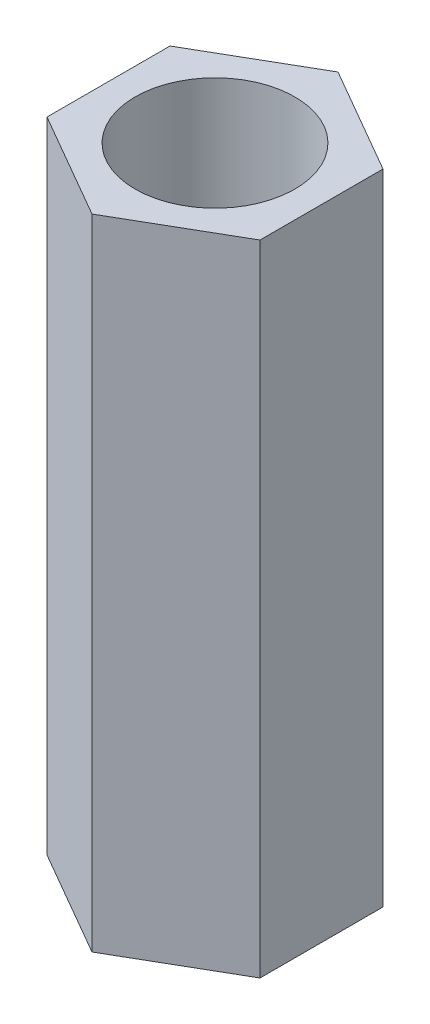
ISO-10303-21;
HEADER;
FILE_DESCRIPTION(('STEP AP214'),'2;1');
FILE_NAME('part.step','',(''),(''),'','','');
FILE_SCHEMA(('AUTOMOTIVE_DESIGN { 1 0 10303 214 1 1 1 1 }'));
ENDSEC;
DATA;
#1=APPLICATION_CONTEXT('core data for automotive mechanical design processes');
#2=APPLICATION_PROTOCOL_DEFINITION('international standard','automotive_design',2000,#1);
#3=PRODUCT_CONTEXT('',#1,'mechanical');
#4=PRODUCT('Part','Part','',(#3));
#5=PRODUCT_RELATED_PRODUCT_CATEGORY('part','',(#4));
#6=PRODUCT_DEFINITION_FORMATION('','',#4);
#7=PRODUCT_DEFINITION_CONTEXT('part definition',#1,'design');
#8=PRODUCT_DEFINITION('design','',#6,#7);
#9=PRODUCT_DEFINITION_SHAPE('','',#8);
#10=(LENGTH_UNIT() NAMED_UNIT(*) SI_UNIT(.MILLI.,.METRE.));
#11=(NAMED_UNIT(*) PLANE_ANGLE_UNIT() SI_UNIT($,.RADIAN.));
#12=(NAMED_UNIT(*) SI_UNIT($,.STERADIAN.) SOLID_ANGLE_UNIT());
#13=UNCERTAINTY_MEASURE_WITH_UNIT(LENGTH_MEASURE(1.E-05),#10,'distance_accuracy_value','');
#14=(GEOMETRIC_REPRESENTATION_CONTEXT(3) GLOBAL_UNCERTAINTY_ASSIGNED_CONTEXT((#13)) GLOBAL_UNIT_ASSIGNED_CONTEXT((#10,
#11,#12)) REPRESENTATION_CONTEXT('',''));
#15=CARTESIAN_POINT('',(0.,0.,0.));
#16=DIRECTION('',(0.,0.,1.));
#17=DIRECTION('',(1.,0.,0.));
#18=AXIS2_PLACEMENT_3D('',#15,#16,#17);
#19=CARTESIAN_POINT('',(0.,12.,0.));
#20=DIRECTION('',(0.,1.,0.));
#21=DIRECTION('',(0.,0.,1.));
#22=AXIS2_PLACEMENT_3D('',#19,#20,#21);
#23=PLANE('',#22);
#24=DIRECTION('',(-0.866025403784439,0.,-0.5));
#25=VECTOR('',#24,1.);
#26=CARTESIAN_POINT('',(2.,12.,-1.15470053837925));
#27=LINE('',#26,#25);
#28=CARTESIAN_POINT('',(2.,12.,-1.15470053837925));
#29=VERTEX_POINT('',#28);
#30=CARTESIAN_POINT('',(0.,12.,-2.3094010767585));
#31=VERTEX_POINT('',#30);
#32=EDGE_CURVE('E134',#29,#31,#27,.T.);
#33=ORIENTED_EDGE('',*,*,#32,.T.);
#34=DIRECTION('',(-0.866025403784439,0.,0.5));
#35=VECTOR('',#34,1.);
#36=CARTESIAN_POINT('',(0.,12.,-2.3094010767585));
#37=LINE('',#36,#35);
#38=CARTESIAN_POINT('',(-2.,12.,-1.15470053837925));
#39=VERTEX_POINT('',#38);
#40=EDGE_CURVE('E92',#31,#39,#37,.T.);
#41=ORIENTED_EDGE('',*,*,#40,.T.);
#42=DIRECTION('',(0.,0.,1.));
#43=VECTOR('',#42,1.);
#44=CARTESIAN_POINT('',(-2.,12.,-1.15470053837925));
#45=LINE('',#44,#43);
#46=CARTESIAN_POINT('',(-2.,12.,1.15470053837925));
#47=VERTEX_POINT('',#46);
#48=EDGE_CURVE('E105',#39,#47,#45,.T.);
#49=ORIENTED_EDGE('',*,*,#48,.T.);
#50=DIRECTION('',(0.866025403784439,0.,0.5));
#51=VECTOR('',#50,1.);
#52=CARTESIAN_POINT('',(-2.,12.,1.15470053837925));
#53=LINE('',#52,#51);
#54=CARTESIAN_POINT('',(0.,12.,2.3094010767585));
#55=VERTEX_POINT('',#54);
#56=EDGE_CURVE('E99',#47,#55,#53,.T.);
#57=ORIENTED_EDGE('',*,*,#56,.T.);
#58=DIRECTION('',(0.866025403784439,0.,-0.5));
#59=VECTOR('',#58,1.);
#60=CARTESIAN_POINT('',(0.,12.,2.3094010767585));
#61=LINE('',#60,#59);
#62=CARTESIAN_POINT('',(2.,12.,1.15470053837925));
#63=VERTEX_POINT('',#62);
#64=EDGE_CURVE('E103',#55,#63,#61,.T.);
#65=ORIENTED_EDGE('',*,*,#64,.T.);
#66=DIRECTION('',(0.,0.,-1.));
#67=VECTOR('',#66,1.);
#68=CARTESIAN_POINT('',(2.,12.,1.15470053837925));
#69=LINE('',#68,#67);
#70=EDGE_CURVE('E55',#63,#29,#69,.T.);
#71=ORIENTED_EDGE('',*,*,#70,.T.);
#72=EDGE_LOOP('',(#33,#41,#49,#57,#65,#71));
#73=FACE_BOUND('',#72,.T.);
#74=CARTESIAN_POINT('',(0.,12.,0.));
#75=DIRECTION('',(0.,1.,0.));
#76=DIRECTION('',(0.,0.,1.));
#77=AXIS2_PLACEMENT_3D('',#74,#75,#76);
#78=CIRCLE('',#77,1.5);
#79=CARTESIAN_POINT('',(0.,12.,1.5));
#80=VERTEX_POINT('',#79);
#81=EDGE_CURVE('E127',#80,#80,#78,.T.);
#82=ORIENTED_EDGE('',*,*,#81,.F.);
#83=EDGE_LOOP('',(#82));
#84=FACE_BOUND('',#83,.T.);
#85=ADVANCED_FACE('F38',(#73,#84),#23,.T.);
#86=CARTESIAN_POINT('',(0.,0.,0.));
#87=DIRECTION('',(0.,1.,0.));
#88=DIRECTION('',(0.,0.,1.));
#89=AXIS2_PLACEMENT_3D('',#86,#87,#88);
#90=PLANE('',#89);
#91=DIRECTION('',(-0.866025403784439,0.,-0.5));
#92=VECTOR('',#91,1.);
#93=CARTESIAN_POINT('',(2.,0.,-1.15470053837925));
#94=LINE('',#93,#92);
#95=CARTESIAN_POINT('',(2.,0.,-1.15470053837925));
#96=VERTEX_POINT('',#95);
#97=CARTESIAN_POINT('',(0.,0.,-2.3094010767585));
#98=VERTEX_POINT('',#97);
#99=EDGE_CURVE('E123',#96,#98,#94,.T.);
#100=ORIENTED_EDGE('',*,*,#99,.F.);
#101=DIRECTION('',(0.,0.,-1.));
#102=VECTOR('',#101,1.);
#103=CARTESIAN_POINT('',(2.,0.,1.15470053837925));
#104=LINE('',#103,#102);
#105=CARTESIAN_POINT('',(2.,0.,1.15470053837925));
#106=VERTEX_POINT('',#105);
#107=EDGE_CURVE('E84',#106,#96,#104,.T.);
#108=ORIENTED_EDGE('',*,*,#107,.F.);
#109=DIRECTION('',(0.866025403784439,0.,-0.5));
#110=VECTOR('',#109,1.);
#111=CARTESIAN_POINT('',(0.,0.,2.3094010767585));
#112=LINE('',#111,#110);
#113=CARTESIAN_POINT('',(0.,0.,2.3094010767585));
#114=VERTEX_POINT('',#113);
#115=EDGE_CURVE('E78',#114,#106,#112,.T.);
#116=ORIENTED_EDGE('',*,*,#115,.F.);
#117=DIRECTION('',(0.866025403784439,0.,0.5));
#118=VECTOR('',#117,1.);
#119=CARTESIAN_POINT('',(-2.,0.,1.15470053837925));
#120=LINE('',#119,#118);
#121=CARTESIAN_POINT('',(-2.,0.,1.15470053837925));
#122=VERTEX_POINT('',#121);
#123=EDGE_CURVE('E113',#122,#114,#120,.T.);
#124=ORIENTED_EDGE('',*,*,#123,.F.);
#125=DIRECTION('',(0.,0.,1.));
#126=VECTOR('',#125,1.);
#127=CARTESIAN_POINT('',(-2.,0.,-1.15470053837925));
#128=LINE('',#127,#126);
#129=CARTESIAN_POINT('',(-2.,0.,-1.15470053837925));
#130=VERTEX_POINT('',#129);
#131=EDGE_CURVE('E129',#130,#122,#128,.T.);
#132=ORIENTED_EDGE('',*,*,#131,.F.);
#133=DIRECTION('',(-0.866025403784439,0.,0.5));
#134=VECTOR('',#133,1.);
#135=CARTESIAN_POINT('',(0.,0.,-2.3094010767585));
#136=LINE('',#135,#134);
#137=EDGE_CURVE('E126',#98,#130,#136,.T.);
#138=ORIENTED_EDGE('',*,*,#137,.F.);
#139=EDGE_LOOP('',(#100,#108,#116,#124,#132,#138));
#140=FACE_BOUND('',#139,.T.);
#141=CARTESIAN_POINT('',(0.,0.,0.));
#142=DIRECTION('',(0.,1.,0.));
#143=DIRECTION('',(0.,0.,1.));
#144=AXIS2_PLACEMENT_3D('',#141,#142,#143);
#145=CIRCLE('',#144,1.5);
#146=CARTESIAN_POINT('',(0.,0.,1.5));
#147=VERTEX_POINT('',#146);
#148=EDGE_CURVE('E229',#147,#147,#145,.T.);
#149=ORIENTED_EDGE('',*,*,#148,.T.);
#150=EDGE_LOOP('',(#149));
#151=FACE_BOUND('',#150,.T.);
#152=ADVANCED_FACE('F143',(#140,#151),#90,.F.);
#153=CARTESIAN_POINT('',(2.,12.,-1.15470053837925));
#154=DIRECTION('',(-0.5,0.,0.866025403784439));
#155=DIRECTION('',(0.866025403784439,0.,0.5));
#156=AXIS2_PLACEMENT_3D('',#153,#154,#155);
#157=PLANE('',#156);
#158=ORIENTED_EDGE('',*,*,#99,.T.);
#159=DIRECTION('',(0.,-1.,0.));
#160=VECTOR('',#159,1.);
#161=CARTESIAN_POINT('',(0.,12.,-2.3094010767585));
#162=LINE('',#161,#160);
#163=EDGE_CURVE('E11',#31,#98,#162,.T.);
#164=ORIENTED_EDGE('',*,*,#163,.F.);
#165=ORIENTED_EDGE('',*,*,#32,.F.);
#166=DIRECTION('',(0.,-1.,0.));
#167=VECTOR('',#166,1.);
#168=CARTESIAN_POINT('',(2.,12.,-1.15470053837925));
#169=LINE('',#168,#167);
#170=EDGE_CURVE('E119',#29,#96,#169,.T.);
#171=ORIENTED_EDGE('',*,*,#170,.T.);
#172=EDGE_LOOP('',(#158,#164,#165,#171));
#173=FACE_BOUND('',#172,.T.);
#174=ADVANCED_FACE('F40',(#173),#157,.F.);
#175=CARTESIAN_POINT('',(0.,12.,-2.3094010767585));
#176=DIRECTION('',(0.5,0.,0.866025403784438));
#177=DIRECTION('',(0.866025403784439,0.,-0.5));
#178=AXIS2_PLACEMENT_3D('',#175,#176,#177);
#179=PLANE('',#178);
#180=ORIENTED_EDGE('',*,*,#137,.T.);
#181=DIRECTION('',(0.,-1.,0.));
#182=VECTOR('',#181,1.);
#183=CARTESIAN_POINT('',(-2.,12.,-1.15470053837925));
#184=LINE('',#183,#182);
#185=EDGE_CURVE('E47',#39,#130,#184,.T.);
#186=ORIENTED_EDGE('',*,*,#185,.F.);
#187=ORIENTED_EDGE('',*,*,#40,.F.);
#188=ORIENTED_EDGE('',*,*,#163,.T.);
#189=EDGE_LOOP('',(#180,#186,#187,#188));
#190=FACE_BOUND('',#189,.T.);
#191=ADVANCED_FACE('F168',(#190),#179,.F.);
#192=CARTESIAN_POINT('',(-2.,12.,-1.15470053837925));
#193=DIRECTION('',(1.,0.,0.));
#194=DIRECTION('',(0.,0.,-1.));
#195=AXIS2_PLACEMENT_3D('',#192,#193,#194);
#196=PLANE('',#195);
#197=ORIENTED_EDGE('',*,*,#131,.T.);
#198=DIRECTION('',(0.,-1.,0.));
#199=VECTOR('',#198,1.);
#200=CARTESIAN_POINT('',(-2.,12.,1.15470053837925));
#201=LINE('',#200,#199);
#202=EDGE_CURVE('E114',#47,#122,#201,.T.);
#203=ORIENTED_EDGE('',*,*,#202,.F.);
#204=ORIENTED_EDGE('',*,*,#48,.F.);
#205=ORIENTED_EDGE('',*,*,#185,.T.);
#206=EDGE_LOOP('',(#197,#203,#204,#205));
#207=FACE_BOUND('',#206,.T.);
#208=ADVANCED_FACE('F140',(#207),#196,.F.);
#209=CARTESIAN_POINT('',(-2.,12.,1.15470053837925));
#210=DIRECTION('',(0.5,0.,-0.866025403784439));
#211=DIRECTION('',(-0.866025403784439,0.,-0.5));
#212=AXIS2_PLACEMENT_3D('',#209,#210,#211);
#213=PLANE('',#212);
#214=ORIENTED_EDGE('',*,*,#123,.T.);
#215=DIRECTION('',(0.,-1.,0.));
#216=VECTOR('',#215,1.);
#217=CARTESIAN_POINT('',(0.,12.,2.3094010767585));
#218=LINE('',#217,#216);
#219=EDGE_CURVE('E110',#55,#114,#218,.T.);
#220=ORIENTED_EDGE('',*,*,#219,.F.);
#221=ORIENTED_EDGE('',*,*,#56,.F.);
#222=ORIENTED_EDGE('',*,*,#202,.T.);
#223=EDGE_LOOP('',(#214,#220,#221,#222));
#224=FACE_BOUND('',#223,.T.);
#225=ADVANCED_FACE('F111',(#224),#213,.F.);
#226=CARTESIAN_POINT('',(0.,12.,2.3094010767585));
#227=DIRECTION('',(-0.5,0.,-0.866025403784439));
#228=DIRECTION('',(-0.866025403784439,0.,0.5));
#229=AXIS2_PLACEMENT_3D('',#226,#227,#228);
#230=PLANE('',#229);
#231=ORIENTED_EDGE('',*,*,#115,.T.);
#232=DIRECTION('',(0.,-1.,0.));
#233=VECTOR('',#232,1.);
#234=CARTESIAN_POINT('',(2.,12.,1.15470053837925));
#235=LINE('',#234,#233);
#236=EDGE_CURVE('E115',#63,#106,#235,.T.);
#237=ORIENTED_EDGE('',*,*,#236,.F.);
#238=ORIENTED_EDGE('',*,*,#64,.F.);
#239=ORIENTED_EDGE('',*,*,#219,.T.);
#240=EDGE_LOOP('',(#231,#237,#238,#239));
#241=FACE_BOUND('',#240,.T.);
#242=ADVANCED_FACE('F117',(#241),#230,.F.);
#243=CARTESIAN_POINT('',(2.,12.,1.15470053837925));
#244=DIRECTION('',(-1.,0.,0.));
#245=DIRECTION('',(0.,0.,1.));
#246=AXIS2_PLACEMENT_3D('',#243,#244,#245);
#247=PLANE('',#246);
#248=ORIENTED_EDGE('',*,*,#107,.T.);
#249=ORIENTED_EDGE('',*,*,#170,.F.);
#250=ORIENTED_EDGE('',*,*,#70,.F.);
#251=ORIENTED_EDGE('',*,*,#236,.T.);
#252=EDGE_LOOP('',(#248,#249,#250,#251));
#253=FACE_BOUND('',#252,.T.);
#254=ADVANCED_FACE('F148',(#253),#247,.F.);
#255=CARTESIAN_POINT('',(0.,12.,0.));
#256=DIRECTION('',(0.,-1.,0.));
#257=DIRECTION('',(0.,0.,-1.));
#258=AXIS2_PLACEMENT_3D('',#255,#256,#257);
#259=CYLINDRICAL_SURFACE('',#258,1.5);
#260=ORIENTED_EDGE('',*,*,#81,.T.);
#261=EDGE_LOOP('',(#260));
#262=FACE_BOUND('',#261,.T.);
#263=ORIENTED_EDGE('',*,*,#148,.F.);
#264=EDGE_LOOP('',(#263));
#265=FACE_BOUND('',#264,.T.);
#266=ADVANCED_FACE('F150',(#262,#265),#259,.F.);
#267=CLOSED_SHELL('',(#85,#152,#174,#191,#208,#225,#242,#254,#266));
#268=MANIFOLD_SOLID_BREP('B2',#267);
#269=ADVANCED_BREP_SHAPE_REPRESENTATION('',(#18,#268),#14);
#270=SHAPE_DEFINITION_REPRESENTATION(#9,#269);
ENDSEC;
END-ISO-10303-21;
